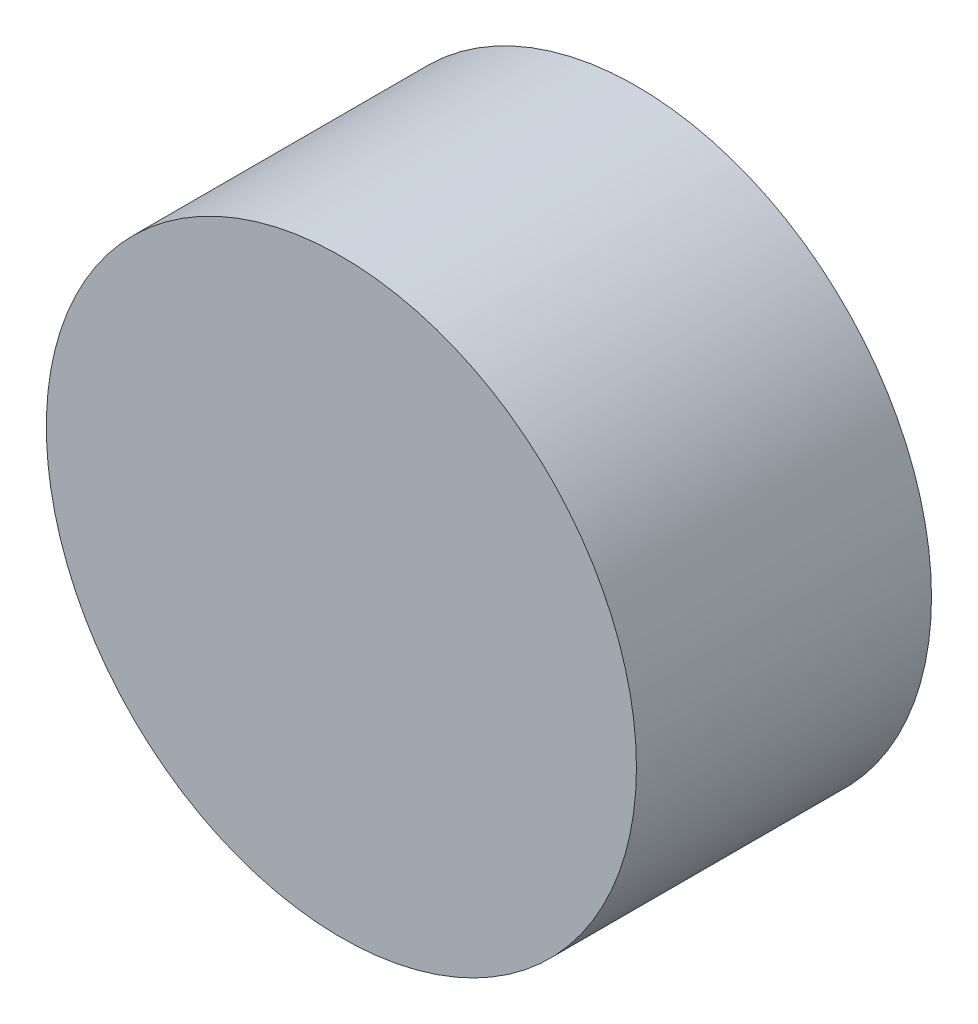
ISO-10303-21;
HEADER;
FILE_DESCRIPTION(('STEP AP214'),'2;1');
FILE_NAME('part.step','',(''),(''),'','','');
FILE_SCHEMA(('AUTOMOTIVE_DESIGN { 1 0 10303 214 1 1 1 1 }'));
ENDSEC;
DATA;
#1=APPLICATION_CONTEXT('core data for automotive mechanical design processes');
#2=APPLICATION_PROTOCOL_DEFINITION('international standard','automotive_design',2000,#1);
#3=PRODUCT_CONTEXT('',#1,'mechanical');
#4=PRODUCT('Part','Part','',(#3));
#5=PRODUCT_RELATED_PRODUCT_CATEGORY('part','',(#4));
#6=PRODUCT_DEFINITION_FORMATION('','',#4);
#7=PRODUCT_DEFINITION_CONTEXT('part definition',#1,'design');
#8=PRODUCT_DEFINITION('design','',#6,#7);
#9=PRODUCT_DEFINITION_SHAPE('','',#8);
#10=(LENGTH_UNIT() NAMED_UNIT(*) SI_UNIT(.MILLI.,.METRE.));
#11=(NAMED_UNIT(*) PLANE_ANGLE_UNIT() SI_UNIT($,.RADIAN.));
#12=(NAMED_UNIT(*) SI_UNIT($,.STERADIAN.) SOLID_ANGLE_UNIT());
#13=UNCERTAINTY_MEASURE_WITH_UNIT(LENGTH_MEASURE(1.E-05),#10,'distance_accuracy_value','');
#14=(GEOMETRIC_REPRESENTATION_CONTEXT(3) GLOBAL_UNCERTAINTY_ASSIGNED_CONTEXT((#13)) GLOBAL_UNIT_ASSIGNED_CONTEXT((#10,
#11,#12)) REPRESENTATION_CONTEXT('',''));
#15=CARTESIAN_POINT('',(0.,0.,0.));
#16=DIRECTION('',(0.,0.,1.));
#17=DIRECTION('',(1.,0.,0.));
#18=AXIS2_PLACEMENT_3D('',#15,#16,#17);
#19=CARTESIAN_POINT('',(0.,0.,3.));
#20=DIRECTION('',(0.,0.,-1.));
#21=DIRECTION('',(-1.,0.,0.));
#22=AXIS2_PLACEMENT_3D('',#19,#20,#21);
#23=CYLINDRICAL_SURFACE('',#22,3.);
#24=CARTESIAN_POINT('',(0.,0.,3.));
#25=DIRECTION('',(0.,0.,1.));
#26=DIRECTION('',(1.,0.,0.));
#27=AXIS2_PLACEMENT_3D('',#24,#25,#26);
#28=CIRCLE('',#27,3.);
#29=CARTESIAN_POINT('',(3.,0.,3.));
#30=VERTEX_POINT('',#29);
#31=EDGE_CURVE('E10',#30,#30,#28,.T.);
#32=ORIENTED_EDGE('',*,*,#31,.F.);
#33=EDGE_LOOP('',(#32));
#34=FACE_BOUND('',#33,.T.);
#35=CARTESIAN_POINT('',(0.,0.,0.));
#36=DIRECTION('',(0.,0.,1.));
#37=DIRECTION('',(1.,0.,0.));
#38=AXIS2_PLACEMENT_3D('',#35,#36,#37);
#39=CIRCLE('',#38,3.);
#40=CARTESIAN_POINT('',(3.,0.,0.));
#41=VERTEX_POINT('',#40);
#42=EDGE_CURVE('E33',#41,#41,#39,.T.);
#43=ORIENTED_EDGE('',*,*,#42,.T.);
#44=EDGE_LOOP('',(#43));
#45=FACE_BOUND('',#44,.T.);
#46=ADVANCED_FACE('F30',(#34,#45),#23,.T.);
#47=CARTESIAN_POINT('',(0.,0.,3.));
#48=DIRECTION('',(0.,0.,1.));
#49=DIRECTION('',(1.,0.,0.));
#50=AXIS2_PLACEMENT_3D('',#47,#48,#49);
#51=PLANE('',#50);
#52=ORIENTED_EDGE('',*,*,#31,.T.);
#53=EDGE_LOOP('',(#52));
#54=FACE_BOUND('',#53,.T.);
#55=ADVANCED_FACE('F45',(#54),#51,.T.);
#56=CARTESIAN_POINT('',(0.,0.,0.));
#57=DIRECTION('',(0.,0.,1.));
#58=DIRECTION('',(1.,0.,0.));
#59=AXIS2_PLACEMENT_3D('',#56,#57,#58);
#60=PLANE('',#59);
#61=ORIENTED_EDGE('',*,*,#42,.F.);
#62=EDGE_LOOP('',(#61));
#63=FACE_BOUND('',#62,.T.);
#64=ADVANCED_FACE('F43',(#63),#60,.F.);
#65=CLOSED_SHELL('',(#46,#55,#64));
#66=MANIFOLD_SOLID_BREP('B2',#65);
#67=ADVANCED_BREP_SHAPE_REPRESENTATION('',(#18,#66),#14);
#68=SHAPE_DEFINITION_REPRESENTATION(#9,#67);
ENDSEC;
END-ISO-10303-21;
